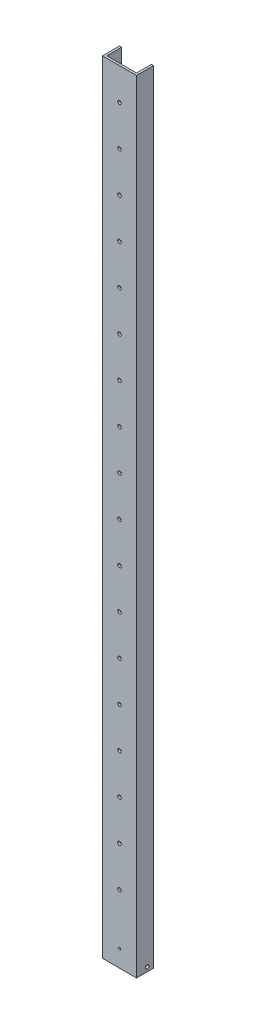
ISO-10303-21;
HEADER;
FILE_DESCRIPTION(('STEP AP214'),'2;1');
FILE_NAME('part.step','',(''),(''),'','','');
FILE_SCHEMA(('AUTOMOTIVE_DESIGN { 1 0 10303 214 1 1 1 1 }'));
ENDSEC;
DATA;
#1=APPLICATION_CONTEXT('core data for automotive mechanical design processes');
#2=APPLICATION_PROTOCOL_DEFINITION('international standard','automotive_design',2000,#1);
#3=PRODUCT_CONTEXT('',#1,'mechanical');
#4=PRODUCT('Part','Part','',(#3));
#5=PRODUCT_RELATED_PRODUCT_CATEGORY('part','',(#4));
#6=PRODUCT_DEFINITION_FORMATION('','',#4);
#7=PRODUCT_DEFINITION_CONTEXT('part definition',#1,'design');
#8=PRODUCT_DEFINITION('design','',#6,#7);
#9=PRODUCT_DEFINITION_SHAPE('','',#8);
#10=(LENGTH_UNIT() NAMED_UNIT(*) SI_UNIT(.MILLI.,.METRE.));
#11=(NAMED_UNIT(*) PLANE_ANGLE_UNIT() SI_UNIT($,.RADIAN.));
#12=(NAMED_UNIT(*) SI_UNIT($,.STERADIAN.) SOLID_ANGLE_UNIT());
#13=UNCERTAINTY_MEASURE_WITH_UNIT(LENGTH_MEASURE(1.E-05),#10,'distance_accuracy_value','');
#14=(GEOMETRIC_REPRESENTATION_CONTEXT(3) GLOBAL_UNCERTAINTY_ASSIGNED_CONTEXT((#13)) GLOBAL_UNIT_ASSIGNED_CONTEXT((#10,
#11,#12)) REPRESENTATION_CONTEXT('',''));
#15=CARTESIAN_POINT('',(0.,0.,0.));
#16=DIRECTION('',(0.,0.,1.));
#17=DIRECTION('',(1.,0.,0.));
#18=AXIS2_PLACEMENT_3D('',#15,#16,#17);
#19=CARTESIAN_POINT('',(0.,1168.4,0.));
#20=DIRECTION('',(1.,0.,0.));
#21=DIRECTION('',(0.,0.,-1.));
#22=AXIS2_PLACEMENT_3D('',#19,#20,#21);
#23=PLANE('',#22);
#24=CARTESIAN_POINT('',(0.,6.35,-15.875));
#25=DIRECTION('',(-1.,0.,0.));
#26=DIRECTION('',(0.,0.,1.));
#27=AXIS2_PLACEMENT_3D('',#24,#25,#26);
#28=CIRCLE('',#27,2.667);
#29=CARTESIAN_POINT('',(0.,6.35,-13.208));
#30=VERTEX_POINT('',#29);
#31=EDGE_CURVE('E295',#30,#30,#28,.T.);
#32=ORIENTED_EDGE('',*,*,#31,.F.);
#33=EDGE_LOOP('',(#32));
#34=FACE_BOUND('',#33,.T.);
#35=DIRECTION('',(0.,0.,1.));
#36=VECTOR('',#35,1.);
#37=CARTESIAN_POINT('',(0.,0.,0.));
#38=LINE('',#37,#36);
#39=CARTESIAN_POINT('',(0.,0.,-25.4));
#40=VERTEX_POINT('',#39);
#41=CARTESIAN_POINT('',(0.,0.,0.));
#42=VERTEX_POINT('',#41);
#43=EDGE_CURVE('E130',#40,#42,#38,.T.);
#44=ORIENTED_EDGE('',*,*,#43,.T.);
#45=DIRECTION('',(0.,-1.,0.));
#46=VECTOR('',#45,1.);
#47=CARTESIAN_POINT('',(0.,1168.4,0.));
#48=LINE('',#47,#46);
#49=CARTESIAN_POINT('',(0.,1168.4,0.));
#50=VERTEX_POINT('',#49);
#51=EDGE_CURVE('E11',#50,#42,#48,.T.);
#52=ORIENTED_EDGE('',*,*,#51,.F.);
#53=DIRECTION('',(0.,0.,1.));
#54=VECTOR('',#53,1.);
#55=CARTESIAN_POINT('',(0.,1168.4,0.));
#56=LINE('',#55,#54);
#57=CARTESIAN_POINT('',(0.,1168.4,-25.4));
#58=VERTEX_POINT('',#57);
#59=EDGE_CURVE('E145',#58,#50,#56,.T.);
#60=ORIENTED_EDGE('',*,*,#59,.F.);
#61=DIRECTION('',(0.,-1.,0.));
#62=VECTOR('',#61,1.);
#63=CARTESIAN_POINT('',(0.,1168.4,-25.4));
#64=LINE('',#63,#62);
#65=EDGE_CURVE('E126',#58,#40,#64,.T.);
#66=ORIENTED_EDGE('',*,*,#65,.T.);
#67=EDGE_LOOP('',(#44,#52,#60,#66));
#68=FACE_BOUND('',#67,.T.);
#69=ADVANCED_FACE('F33',(#34,#68),#23,.F.);
#70=CARTESIAN_POINT('',(0.,1168.4,0.));
#71=DIRECTION('',(0.,0.,-1.));
#72=DIRECTION('',(-1.,0.,0.));
#73=AXIS2_PLACEMENT_3D('',#70,#71,#72);
#74=PLANE('',#73);
#75=CARTESIAN_POINT('',(25.4,25.4,0.));
#76=DIRECTION('',(0.,0.,-1.));
#77=DIRECTION('',(-1.,0.,0.));
#78=AXIS2_PLACEMENT_3D('',#75,#76,#77);
#79=CIRCLE('',#78,1.5875);
#80=CARTESIAN_POINT('',(23.8125,25.4,0.));
#81=VERTEX_POINT('',#80);
#82=EDGE_CURVE('E186',#81,#81,#79,.F.);
#83=ORIENTED_EDGE('',*,*,#82,.F.);
#84=EDGE_LOOP('',(#83));
#85=FACE_BOUND('',#84,.T.);
#86=CARTESIAN_POINT('',(25.4,101.6,0.));
#87=DIRECTION('',(0.,0.,1.));
#88=DIRECTION('',(1.,0.,0.));
#89=AXIS2_PLACEMENT_3D('',#86,#87,#88);
#90=CIRCLE('',#89,2.667);
#91=CARTESIAN_POINT('',(28.067,101.6,0.));
#92=VERTEX_POINT('',#91);
#93=EDGE_CURVE('E280',#92,#92,#90,.T.);
#94=ORIENTED_EDGE('',*,*,#93,.F.);
#95=EDGE_LOOP('',(#94));
#96=FACE_BOUND('',#95,.T.);
#97=CARTESIAN_POINT('',(25.4,161.544,0.));
#98=DIRECTION('',(0.,0.,1.));
#99=DIRECTION('',(1.,0.,0.));
#100=AXIS2_PLACEMENT_3D('',#97,#98,#99);
#101=CIRCLE('',#100,2.667);
#102=CARTESIAN_POINT('',(28.067,161.544,0.));
#103=VERTEX_POINT('',#102);
#104=EDGE_CURVE('E274',#103,#103,#101,.T.);
#105=ORIENTED_EDGE('',*,*,#104,.F.);
#106=EDGE_LOOP('',(#105));
#107=FACE_BOUND('',#106,.T.);
#108=CARTESIAN_POINT('',(25.4,221.488,0.));
#109=DIRECTION('',(0.,0.,1.));
#110=DIRECTION('',(1.,0.,0.));
#111=AXIS2_PLACEMENT_3D('',#108,#109,#110);
#112=CIRCLE('',#111,2.667);
#113=CARTESIAN_POINT('',(28.067,221.488,0.));
#114=VERTEX_POINT('',#113);
#115=EDGE_CURVE('E268',#114,#114,#112,.T.);
#116=ORIENTED_EDGE('',*,*,#115,.F.);
#117=EDGE_LOOP('',(#116));
#118=FACE_BOUND('',#117,.T.);
#119=CARTESIAN_POINT('',(25.4,281.432,0.));
#120=DIRECTION('',(0.,0.,1.));
#121=DIRECTION('',(1.,0.,0.));
#122=AXIS2_PLACEMENT_3D('',#119,#120,#121);
#123=CIRCLE('',#122,2.667);
#124=CARTESIAN_POINT('',(28.067,281.432,0.));
#125=VERTEX_POINT('',#124);
#126=EDGE_CURVE('E262',#125,#125,#123,.T.);
#127=ORIENTED_EDGE('',*,*,#126,.F.);
#128=EDGE_LOOP('',(#127));
#129=FACE_BOUND('',#128,.T.);
#130=CARTESIAN_POINT('',(25.4,341.376,0.));
#131=DIRECTION('',(0.,0.,1.));
#132=DIRECTION('',(1.,0.,0.));
#133=AXIS2_PLACEMENT_3D('',#130,#131,#132);
#134=CIRCLE('',#133,2.667);
#135=CARTESIAN_POINT('',(28.067,341.376,0.));
#136=VERTEX_POINT('',#135);
#137=EDGE_CURVE('E256',#136,#136,#134,.T.);
#138=ORIENTED_EDGE('',*,*,#137,.F.);
#139=EDGE_LOOP('',(#138));
#140=FACE_BOUND('',#139,.T.);
#141=CARTESIAN_POINT('',(25.4,401.32,0.));
#142=DIRECTION('',(0.,0.,1.));
#143=DIRECTION('',(1.,0.,0.));
#144=AXIS2_PLACEMENT_3D('',#141,#142,#143);
#145=CIRCLE('',#144,2.667);
#146=CARTESIAN_POINT('',(28.067,401.32,0.));
#147=VERTEX_POINT('',#146);
#148=EDGE_CURVE('E250',#147,#147,#145,.T.);
#149=ORIENTED_EDGE('',*,*,#148,.F.);
#150=EDGE_LOOP('',(#149));
#151=FACE_BOUND('',#150,.T.);
#152=CARTESIAN_POINT('',(25.4,461.264,0.));
#153=DIRECTION('',(0.,0.,1.));
#154=DIRECTION('',(1.,0.,0.));
#155=AXIS2_PLACEMENT_3D('',#152,#153,#154);
#156=CIRCLE('',#155,2.667);
#157=CARTESIAN_POINT('',(28.067,461.264,0.));
#158=VERTEX_POINT('',#157);
#159=EDGE_CURVE('E244',#158,#158,#156,.T.);
#160=ORIENTED_EDGE('',*,*,#159,.F.);
#161=EDGE_LOOP('',(#160));
#162=FACE_BOUND('',#161,.T.);
#163=CARTESIAN_POINT('',(25.4,521.208,0.));
#164=DIRECTION('',(0.,0.,1.));
#165=DIRECTION('',(1.,0.,0.));
#166=AXIS2_PLACEMENT_3D('',#163,#164,#165);
#167=CIRCLE('',#166,2.667);
#168=CARTESIAN_POINT('',(28.067,521.208,0.));
#169=VERTEX_POINT('',#168);
#170=EDGE_CURVE('E238',#169,#169,#167,.T.);
#171=ORIENTED_EDGE('',*,*,#170,.F.);
#172=EDGE_LOOP('',(#171));
#173=FACE_BOUND('',#172,.T.);
#174=CARTESIAN_POINT('',(25.4,581.152,0.));
#175=DIRECTION('',(0.,0.,1.));
#176=DIRECTION('',(1.,0.,0.));
#177=AXIS2_PLACEMENT_3D('',#174,#175,#176);
#178=CIRCLE('',#177,2.66700000000003);
#179=CARTESIAN_POINT('',(28.067,581.152,0.));
#180=VERTEX_POINT('',#179);
#181=EDGE_CURVE('E232',#180,#180,#178,.T.);
#182=ORIENTED_EDGE('',*,*,#181,.F.);
#183=EDGE_LOOP('',(#182));
#184=FACE_BOUND('',#183,.T.);
#185=CARTESIAN_POINT('',(25.4,641.096,0.));
#186=DIRECTION('',(0.,0.,1.));
#187=DIRECTION('',(1.,0.,0.));
#188=AXIS2_PLACEMENT_3D('',#185,#186,#187);
#189=CIRCLE('',#188,2.667);
#190=CARTESIAN_POINT('',(28.067,641.096,0.));
#191=VERTEX_POINT('',#190);
#192=EDGE_CURVE('E226',#191,#191,#189,.T.);
#193=ORIENTED_EDGE('',*,*,#192,.F.);
#194=EDGE_LOOP('',(#193));
#195=FACE_BOUND('',#194,.T.);
#196=CARTESIAN_POINT('',(25.4,701.04,0.));
#197=DIRECTION('',(0.,0.,1.));
#198=DIRECTION('',(1.,0.,0.));
#199=AXIS2_PLACEMENT_3D('',#196,#197,#198);
#200=CIRCLE('',#199,2.667);
#201=CARTESIAN_POINT('',(28.067,701.04,0.));
#202=VERTEX_POINT('',#201);
#203=EDGE_CURVE('E220',#202,#202,#200,.T.);
#204=ORIENTED_EDGE('',*,*,#203,.F.);
#205=EDGE_LOOP('',(#204));
#206=FACE_BOUND('',#205,.T.);
#207=CARTESIAN_POINT('',(25.4,760.984,0.));
#208=DIRECTION('',(0.,0.,1.));
#209=DIRECTION('',(1.,0.,0.));
#210=AXIS2_PLACEMENT_3D('',#207,#208,#209);
#211=CIRCLE('',#210,2.667);
#212=CARTESIAN_POINT('',(28.067,760.984,0.));
#213=VERTEX_POINT('',#212);
#214=EDGE_CURVE('E214',#213,#213,#211,.T.);
#215=ORIENTED_EDGE('',*,*,#214,.F.);
#216=EDGE_LOOP('',(#215));
#217=FACE_BOUND('',#216,.T.);
#218=CARTESIAN_POINT('',(25.4,820.928,0.));
#219=DIRECTION('',(0.,0.,1.));
#220=DIRECTION('',(1.,0.,0.));
#221=AXIS2_PLACEMENT_3D('',#218,#219,#220);
#222=CIRCLE('',#221,2.667);
#223=CARTESIAN_POINT('',(28.067,820.928,0.));
#224=VERTEX_POINT('',#223);
#225=EDGE_CURVE('E208',#224,#224,#222,.T.);
#226=ORIENTED_EDGE('',*,*,#225,.F.);
#227=EDGE_LOOP('',(#226));
#228=FACE_BOUND('',#227,.T.);
#229=CARTESIAN_POINT('',(25.4,880.872,0.));
#230=DIRECTION('',(0.,0.,1.));
#231=DIRECTION('',(1.,0.,0.));
#232=AXIS2_PLACEMENT_3D('',#229,#230,#231);
#233=CIRCLE('',#232,2.667);
#234=CARTESIAN_POINT('',(28.067,880.872,0.));
#235=VERTEX_POINT('',#234);
#236=EDGE_CURVE('E202',#235,#235,#233,.T.);
#237=ORIENTED_EDGE('',*,*,#236,.F.);
#238=EDGE_LOOP('',(#237));
#239=FACE_BOUND('',#238,.T.);
#240=CARTESIAN_POINT('',(25.4,940.816,0.));
#241=DIRECTION('',(0.,0.,1.));
#242=DIRECTION('',(1.,0.,0.));
#243=AXIS2_PLACEMENT_3D('',#240,#241,#242);
#244=CIRCLE('',#243,2.667);
#245=CARTESIAN_POINT('',(28.067,940.816,0.));
#246=VERTEX_POINT('',#245);
#247=EDGE_CURVE('E196',#246,#246,#244,.T.);
#248=ORIENTED_EDGE('',*,*,#247,.F.);
#249=EDGE_LOOP('',(#248));
#250=FACE_BOUND('',#249,.T.);
#251=CARTESIAN_POINT('',(25.4,1000.76,0.));
#252=DIRECTION('',(0.,0.,1.));
#253=DIRECTION('',(1.,0.,0.));
#254=AXIS2_PLACEMENT_3D('',#251,#252,#253);
#255=CIRCLE('',#254,2.66700000000003);
#256=CARTESIAN_POINT('',(28.067,1000.76,0.));
#257=VERTEX_POINT('',#256);
#258=EDGE_CURVE('E190',#257,#257,#255,.T.);
#259=ORIENTED_EDGE('',*,*,#258,.F.);
#260=EDGE_LOOP('',(#259));
#261=FACE_BOUND('',#260,.T.);
#262=CARTESIAN_POINT('',(25.4,1060.704,0.));
#263=DIRECTION('',(0.,0.,1.));
#264=DIRECTION('',(1.,0.,0.));
#265=AXIS2_PLACEMENT_3D('',#262,#263,#264);
#266=CIRCLE('',#265,2.66700000000003);
#267=CARTESIAN_POINT('',(28.067,1060.704,0.));
#268=VERTEX_POINT('',#267);
#269=EDGE_CURVE('E182',#268,#268,#266,.T.);
#270=ORIENTED_EDGE('',*,*,#269,.F.);
#271=EDGE_LOOP('',(#270));
#272=FACE_BOUND('',#271,.T.);
#273=CARTESIAN_POINT('',(25.4,1120.648,0.));
#274=DIRECTION('',(0.,0.,1.));
#275=DIRECTION('',(1.,0.,0.));
#276=AXIS2_PLACEMENT_3D('',#273,#274,#275);
#277=CIRCLE('',#276,2.66700000000003);
#278=CARTESIAN_POINT('',(28.067,1120.648,0.));
#279=VERTEX_POINT('',#278);
#280=EDGE_CURVE('E183',#279,#279,#277,.T.);
#281=ORIENTED_EDGE('',*,*,#280,.F.);
#282=EDGE_LOOP('',(#281));
#283=FACE_BOUND('',#282,.T.);
#284=DIRECTION('',(1.,0.,0.));
#285=VECTOR('',#284,1.);
#286=CARTESIAN_POINT('',(0.,0.,0.));
#287=LINE('',#286,#285);
#288=CARTESIAN_POINT('',(50.8,0.,0.));
#289=VERTEX_POINT('',#288);
#290=EDGE_CURVE('E133',#42,#289,#287,.T.);
#291=ORIENTED_EDGE('',*,*,#290,.T.);
#292=DIRECTION('',(0.,-1.,0.));
#293=VECTOR('',#292,1.);
#294=CARTESIAN_POINT('',(50.8,1168.4,0.));
#295=LINE('',#294,#293);
#296=CARTESIAN_POINT('',(50.8,1168.4,0.));
#297=VERTEX_POINT('',#296);
#298=EDGE_CURVE('E42',#297,#289,#295,.T.);
#299=ORIENTED_EDGE('',*,*,#298,.F.);
#300=DIRECTION('',(1.,0.,0.));
#301=VECTOR('',#300,1.);
#302=CARTESIAN_POINT('',(0.,1168.4,0.));
#303=LINE('',#302,#301);
#304=EDGE_CURVE('E93',#50,#297,#303,.T.);
#305=ORIENTED_EDGE('',*,*,#304,.F.);
#306=ORIENTED_EDGE('',*,*,#51,.T.);
#307=EDGE_LOOP('',(#291,#299,#305,#306));
#308=FACE_BOUND('',#307,.T.);
#309=ADVANCED_FACE('F321',(#85,#96,#107,#118,#129,#140,#151,#162,#173,#184,#195,#206,#217,#228,
#239,#250,#261,#272,#283,#308),#74,.F.);
#310=CARTESIAN_POINT('',(50.8,1168.4,0.));
#311=DIRECTION('',(-1.,0.,0.));
#312=DIRECTION('',(0.,0.,1.));
#313=AXIS2_PLACEMENT_3D('',#310,#311,#312);
#314=PLANE('',#313);
#315=CARTESIAN_POINT('',(50.8,6.35,-15.875));
#316=DIRECTION('',(-1.,0.,0.));
#317=DIRECTION('',(0.,0.,1.));
#318=AXIS2_PLACEMENT_3D('',#315,#316,#317);
#319=CIRCLE('',#318,2.667);
#320=CARTESIAN_POINT('',(50.8,6.35,-13.208));
#321=VERTEX_POINT('',#320);
#322=EDGE_CURVE('E298',#321,#321,#319,.T.);
#323=ORIENTED_EDGE('',*,*,#322,.T.);
#324=EDGE_LOOP('',(#323));
#325=FACE_BOUND('',#324,.T.);
#326=DIRECTION('',(0.,0.,-1.));
#327=VECTOR('',#326,1.);
#328=CARTESIAN_POINT('',(50.8,0.,0.));
#329=LINE('',#328,#327);
#330=CARTESIAN_POINT('',(50.8,0.,-25.4));
#331=VERTEX_POINT('',#330);
#332=EDGE_CURVE('E136',#289,#331,#329,.T.);
#333=ORIENTED_EDGE('',*,*,#332,.T.);
#334=DIRECTION('',(0.,-1.,0.));
#335=VECTOR('',#334,1.);
#336=CARTESIAN_POINT('',(50.8,1168.4,-25.4));
#337=LINE('',#336,#335);
#338=CARTESIAN_POINT('',(50.8,1168.4,-25.4));
#339=VERTEX_POINT('',#338);
#340=EDGE_CURVE('E152',#339,#331,#337,.T.);
#341=ORIENTED_EDGE('',*,*,#340,.F.);
#342=DIRECTION('',(0.,0.,-1.));
#343=VECTOR('',#342,1.);
#344=CARTESIAN_POINT('',(50.8,1168.4,0.));
#345=LINE('',#344,#343);
#346=EDGE_CURVE('E161',#297,#339,#345,.T.);
#347=ORIENTED_EDGE('',*,*,#346,.F.);
#348=ORIENTED_EDGE('',*,*,#298,.T.);
#349=EDGE_LOOP('',(#333,#341,#347,#348));
#350=FACE_BOUND('',#349,.T.);
#351=ADVANCED_FACE('F159',(#325,#350),#314,.F.);
#352=CARTESIAN_POINT('',(50.8,1168.4,-25.4));
#353=DIRECTION('',(0.,0.,1.));
#354=DIRECTION('',(1.,0.,0.));
#355=AXIS2_PLACEMENT_3D('',#352,#353,#354);
#356=PLANE('',#355);
#357=DIRECTION('',(-1.,0.,0.));
#358=VECTOR('',#357,1.);
#359=CARTESIAN_POINT('',(50.8,0.,-25.4));
#360=LINE('',#359,#358);
#361=CARTESIAN_POINT('',(47.625,0.,-25.4));
#362=VERTEX_POINT('',#361);
#363=EDGE_CURVE('E138',#331,#362,#360,.T.);
#364=ORIENTED_EDGE('',*,*,#363,.T.);
#365=DIRECTION('',(0.,-1.,0.));
#366=VECTOR('',#365,1.);
#367=CARTESIAN_POINT('',(47.625,1168.4,-25.4));
#368=LINE('',#367,#366);
#369=CARTESIAN_POINT('',(47.625,1168.4,-25.4));
#370=VERTEX_POINT('',#369);
#371=EDGE_CURVE('E149',#370,#362,#368,.T.);
#372=ORIENTED_EDGE('',*,*,#371,.F.);
#373=DIRECTION('',(-1.,0.,0.));
#374=VECTOR('',#373,1.);
#375=CARTESIAN_POINT('',(50.8,1168.4,-25.4));
#376=LINE('',#375,#374);
#377=EDGE_CURVE('E173',#339,#370,#376,.T.);
#378=ORIENTED_EDGE('',*,*,#377,.F.);
#379=ORIENTED_EDGE('',*,*,#340,.T.);
#380=EDGE_LOOP('',(#364,#372,#378,#379));
#381=FACE_BOUND('',#380,.T.);
#382=ADVANCED_FACE('F169',(#381),#356,.F.);
#383=CARTESIAN_POINT('',(47.625,1168.4,-3.175));
#384=DIRECTION('',(1.,0.,0.));
#385=DIRECTION('',(0.,0.,-1.));
#386=AXIS2_PLACEMENT_3D('',#383,#384,#385);
#387=PLANE('',#386);
#388=CARTESIAN_POINT('',(47.625,6.35,-15.875));
#389=DIRECTION('',(1.,0.,0.));
#390=DIRECTION('',(0.,0.,-1.));
#391=AXIS2_PLACEMENT_3D('',#388,#389,#390);
#392=CIRCLE('',#391,2.667);
#393=CARTESIAN_POINT('',(47.625,6.35,-18.542));
#394=VERTEX_POINT('',#393);
#395=EDGE_CURVE('E292',#394,#394,#392,.T.);
#396=ORIENTED_EDGE('',*,*,#395,.T.);
#397=EDGE_LOOP('',(#396));
#398=FACE_BOUND('',#397,.T.);
#399=DIRECTION('',(0.,0.,1.));
#400=VECTOR('',#399,1.);
#401=CARTESIAN_POINT('',(47.625,0.,-3.175));
#402=LINE('',#401,#400);
#403=CARTESIAN_POINT('',(47.625,0.,-3.175));
#404=VERTEX_POINT('',#403);
#405=EDGE_CURVE('E140',#362,#404,#402,.T.);
#406=ORIENTED_EDGE('',*,*,#405,.T.);
#407=DIRECTION('',(0.,-1.,0.));
#408=VECTOR('',#407,1.);
#409=CARTESIAN_POINT('',(47.625,1168.4,-3.175));
#410=LINE('',#409,#408);
#411=CARTESIAN_POINT('',(47.625,1168.4,-3.175));
#412=VERTEX_POINT('',#411);
#413=EDGE_CURVE('E121',#412,#404,#410,.T.);
#414=ORIENTED_EDGE('',*,*,#413,.F.);
#415=DIRECTION('',(0.,0.,1.));
#416=VECTOR('',#415,1.);
#417=CARTESIAN_POINT('',(47.625,1168.4,-3.175));
#418=LINE('',#417,#416);
#419=EDGE_CURVE('E112',#370,#412,#418,.T.);
#420=ORIENTED_EDGE('',*,*,#419,.F.);
#421=ORIENTED_EDGE('',*,*,#371,.T.);
#422=EDGE_LOOP('',(#406,#414,#420,#421));
#423=FACE_BOUND('',#422,.T.);
#424=ADVANCED_FACE('F172',(#398,#423),#387,.F.);
#425=CARTESIAN_POINT('',(3.175,1168.4,-3.175));
#426=DIRECTION('',(0.,0.,1.));
#427=DIRECTION('',(1.,0.,0.));
#428=AXIS2_PLACEMENT_3D('',#425,#426,#427);
#429=PLANE('',#428);
#430=CARTESIAN_POINT('',(25.4,25.4,-3.175));
#431=DIRECTION('',(0.,0.,-1.));
#432=DIRECTION('',(-1.,0.,0.));
#433=AXIS2_PLACEMENT_3D('',#430,#431,#432);
#434=CIRCLE('',#433,1.5875);
#435=CARTESIAN_POINT('',(23.8125,25.4,-3.175));
#436=VERTEX_POINT('',#435);
#437=EDGE_CURVE('E289',#436,#436,#434,.T.);
#438=ORIENTED_EDGE('',*,*,#437,.F.);
#439=EDGE_LOOP('',(#438));
#440=FACE_BOUND('',#439,.T.);
#441=CARTESIAN_POINT('',(25.4,101.6,-3.175));
#442=DIRECTION('',(0.,0.,1.));
#443=DIRECTION('',(1.,0.,0.));
#444=AXIS2_PLACEMENT_3D('',#441,#442,#443);
#445=CIRCLE('',#444,2.667);
#446=CARTESIAN_POINT('',(28.067,101.6,-3.175));
#447=VERTEX_POINT('',#446);
#448=EDGE_CURVE('E134',#447,#447,#445,.F.);
#449=ORIENTED_EDGE('',*,*,#448,.F.);
#450=EDGE_LOOP('',(#449));
#451=FACE_BOUND('',#450,.T.);
#452=CARTESIAN_POINT('',(25.4,161.544,-3.175));
#453=DIRECTION('',(0.,0.,1.));
#454=DIRECTION('',(1.,0.,0.));
#455=AXIS2_PLACEMENT_3D('',#452,#453,#454);
#456=CIRCLE('',#455,2.667);
#457=CARTESIAN_POINT('',(28.067,161.544,-3.175));
#458=VERTEX_POINT('',#457);
#459=EDGE_CURVE('E277',#458,#458,#456,.F.);
#460=ORIENTED_EDGE('',*,*,#459,.F.);
#461=EDGE_LOOP('',(#460));
#462=FACE_BOUND('',#461,.T.);
#463=CARTESIAN_POINT('',(25.4,221.488,-3.175));
#464=DIRECTION('',(0.,0.,1.));
#465=DIRECTION('',(1.,0.,0.));
#466=AXIS2_PLACEMENT_3D('',#463,#464,#465);
#467=CIRCLE('',#466,2.667);
#468=CARTESIAN_POINT('',(28.067,221.488,-3.175));
#469=VERTEX_POINT('',#468);
#470=EDGE_CURVE('E271',#469,#469,#467,.F.);
#471=ORIENTED_EDGE('',*,*,#470,.F.);
#472=EDGE_LOOP('',(#471));
#473=FACE_BOUND('',#472,.T.);
#474=CARTESIAN_POINT('',(25.4,281.432,-3.175));
#475=DIRECTION('',(0.,0.,1.));
#476=DIRECTION('',(1.,0.,0.));
#477=AXIS2_PLACEMENT_3D('',#474,#475,#476);
#478=CIRCLE('',#477,2.667);
#479=CARTESIAN_POINT('',(28.067,281.432,-3.175));
#480=VERTEX_POINT('',#479);
#481=EDGE_CURVE('E265',#480,#480,#478,.F.);
#482=ORIENTED_EDGE('',*,*,#481,.F.);
#483=EDGE_LOOP('',(#482));
#484=FACE_BOUND('',#483,.T.);
#485=CARTESIAN_POINT('',(25.4,341.376,-3.175));
#486=DIRECTION('',(0.,0.,1.));
#487=DIRECTION('',(1.,0.,0.));
#488=AXIS2_PLACEMENT_3D('',#485,#486,#487);
#489=CIRCLE('',#488,2.667);
#490=CARTESIAN_POINT('',(28.067,341.376,-3.175));
#491=VERTEX_POINT('',#490);
#492=EDGE_CURVE('E259',#491,#491,#489,.F.);
#493=ORIENTED_EDGE('',*,*,#492,.F.);
#494=EDGE_LOOP('',(#493));
#495=FACE_BOUND('',#494,.T.);
#496=CARTESIAN_POINT('',(25.4,401.32,-3.175));
#497=DIRECTION('',(0.,0.,1.));
#498=DIRECTION('',(1.,0.,0.));
#499=AXIS2_PLACEMENT_3D('',#496,#497,#498);
#500=CIRCLE('',#499,2.667);
#501=CARTESIAN_POINT('',(28.067,401.32,-3.175));
#502=VERTEX_POINT('',#501);
#503=EDGE_CURVE('E253',#502,#502,#500,.F.);
#504=ORIENTED_EDGE('',*,*,#503,.F.);
#505=EDGE_LOOP('',(#504));
#506=FACE_BOUND('',#505,.T.);
#507=CARTESIAN_POINT('',(25.4,461.264,-3.175));
#508=DIRECTION('',(0.,0.,1.));
#509=DIRECTION('',(1.,0.,0.));
#510=AXIS2_PLACEMENT_3D('',#507,#508,#509);
#511=CIRCLE('',#510,2.667);
#512=CARTESIAN_POINT('',(28.067,461.264,-3.175));
#513=VERTEX_POINT('',#512);
#514=EDGE_CURVE('E247',#513,#513,#511,.F.);
#515=ORIENTED_EDGE('',*,*,#514,.F.);
#516=EDGE_LOOP('',(#515));
#517=FACE_BOUND('',#516,.T.);
#518=CARTESIAN_POINT('',(25.4,521.208,-3.175));
#519=DIRECTION('',(0.,0.,1.));
#520=DIRECTION('',(1.,0.,0.));
#521=AXIS2_PLACEMENT_3D('',#518,#519,#520);
#522=CIRCLE('',#521,2.667);
#523=CARTESIAN_POINT('',(28.067,521.208,-3.175));
#524=VERTEX_POINT('',#523);
#525=EDGE_CURVE('E241',#524,#524,#522,.F.);
#526=ORIENTED_EDGE('',*,*,#525,.F.);
#527=EDGE_LOOP('',(#526));
#528=FACE_BOUND('',#527,.T.);
#529=CARTESIAN_POINT('',(25.4,581.152,-3.175));
#530=DIRECTION('',(0.,0.,1.));
#531=DIRECTION('',(1.,0.,0.));
#532=AXIS2_PLACEMENT_3D('',#529,#530,#531);
#533=CIRCLE('',#532,2.66700000000003);
#534=CARTESIAN_POINT('',(28.067,581.152,-3.175));
#535=VERTEX_POINT('',#534);
#536=EDGE_CURVE('E235',#535,#535,#533,.F.);
#537=ORIENTED_EDGE('',*,*,#536,.F.);
#538=EDGE_LOOP('',(#537));
#539=FACE_BOUND('',#538,.T.);
#540=CARTESIAN_POINT('',(25.4,641.096,-3.175));
#541=DIRECTION('',(0.,0.,1.));
#542=DIRECTION('',(1.,0.,0.));
#543=AXIS2_PLACEMENT_3D('',#540,#541,#542);
#544=CIRCLE('',#543,2.667);
#545=CARTESIAN_POINT('',(28.067,641.096,-3.175));
#546=VERTEX_POINT('',#545);
#547=EDGE_CURVE('E229',#546,#546,#544,.F.);
#548=ORIENTED_EDGE('',*,*,#547,.F.);
#549=EDGE_LOOP('',(#548));
#550=FACE_BOUND('',#549,.T.);
#551=CARTESIAN_POINT('',(25.4,701.04,-3.175));
#552=DIRECTION('',(0.,0.,1.));
#553=DIRECTION('',(1.,0.,0.));
#554=AXIS2_PLACEMENT_3D('',#551,#552,#553);
#555=CIRCLE('',#554,2.667);
#556=CARTESIAN_POINT('',(28.067,701.04,-3.175));
#557=VERTEX_POINT('',#556);
#558=EDGE_CURVE('E223',#557,#557,#555,.F.);
#559=ORIENTED_EDGE('',*,*,#558,.F.);
#560=EDGE_LOOP('',(#559));
#561=FACE_BOUND('',#560,.T.);
#562=CARTESIAN_POINT('',(25.4,760.984,-3.175));
#563=DIRECTION('',(0.,0.,1.));
#564=DIRECTION('',(1.,0.,0.));
#565=AXIS2_PLACEMENT_3D('',#562,#563,#564);
#566=CIRCLE('',#565,2.667);
#567=CARTESIAN_POINT('',(28.067,760.984,-3.175));
#568=VERTEX_POINT('',#567);
#569=EDGE_CURVE('E217',#568,#568,#566,.F.);
#570=ORIENTED_EDGE('',*,*,#569,.F.);
#571=EDGE_LOOP('',(#570));
#572=FACE_BOUND('',#571,.T.);
#573=CARTESIAN_POINT('',(25.4,820.928,-3.175));
#574=DIRECTION('',(0.,0.,1.));
#575=DIRECTION('',(1.,0.,0.));
#576=AXIS2_PLACEMENT_3D('',#573,#574,#575);
#577=CIRCLE('',#576,2.667);
#578=CARTESIAN_POINT('',(28.067,820.928,-3.175));
#579=VERTEX_POINT('',#578);
#580=EDGE_CURVE('E211',#579,#579,#577,.F.);
#581=ORIENTED_EDGE('',*,*,#580,.F.);
#582=EDGE_LOOP('',(#581));
#583=FACE_BOUND('',#582,.T.);
#584=CARTESIAN_POINT('',(25.4,880.872,-3.175));
#585=DIRECTION('',(0.,0.,1.));
#586=DIRECTION('',(1.,0.,0.));
#587=AXIS2_PLACEMENT_3D('',#584,#585,#586);
#588=CIRCLE('',#587,2.667);
#589=CARTESIAN_POINT('',(28.067,880.872,-3.175));
#590=VERTEX_POINT('',#589);
#591=EDGE_CURVE('E205',#590,#590,#588,.F.);
#592=ORIENTED_EDGE('',*,*,#591,.F.);
#593=EDGE_LOOP('',(#592));
#594=FACE_BOUND('',#593,.T.);
#595=CARTESIAN_POINT('',(25.4,940.816,-3.175));
#596=DIRECTION('',(0.,0.,1.));
#597=DIRECTION('',(1.,0.,0.));
#598=AXIS2_PLACEMENT_3D('',#595,#596,#597);
#599=CIRCLE('',#598,2.667);
#600=CARTESIAN_POINT('',(28.067,940.816,-3.175));
#601=VERTEX_POINT('',#600);
#602=EDGE_CURVE('E199',#601,#601,#599,.F.);
#603=ORIENTED_EDGE('',*,*,#602,.F.);
#604=EDGE_LOOP('',(#603));
#605=FACE_BOUND('',#604,.T.);
#606=CARTESIAN_POINT('',(25.4,1000.76,-3.175));
#607=DIRECTION('',(0.,0.,1.));
#608=DIRECTION('',(1.,0.,0.));
#609=AXIS2_PLACEMENT_3D('',#606,#607,#608);
#610=CIRCLE('',#609,2.66700000000003);
#611=CARTESIAN_POINT('',(28.067,1000.76,-3.175));
#612=VERTEX_POINT('',#611);
#613=EDGE_CURVE('E193',#612,#612,#610,.F.);
#614=ORIENTED_EDGE('',*,*,#613,.F.);
#615=EDGE_LOOP('',(#614));
#616=FACE_BOUND('',#615,.T.);
#617=CARTESIAN_POINT('',(25.4,1060.704,-3.175));
#618=DIRECTION('',(0.,0.,1.));
#619=DIRECTION('',(1.,0.,0.));
#620=AXIS2_PLACEMENT_3D('',#617,#618,#619);
#621=CIRCLE('',#620,2.66700000000003);
#622=CARTESIAN_POINT('',(28.067,1060.704,-3.175));
#623=VERTEX_POINT('',#622);
#624=EDGE_CURVE('E187',#623,#623,#621,.F.);
#625=ORIENTED_EDGE('',*,*,#624,.F.);
#626=EDGE_LOOP('',(#625));
#627=FACE_BOUND('',#626,.T.);
#628=CARTESIAN_POINT('',(25.4,1120.648,-3.175));
#629=DIRECTION('',(0.,0.,1.));
#630=DIRECTION('',(1.,0.,0.));
#631=AXIS2_PLACEMENT_3D('',#628,#629,#630);
#632=CIRCLE('',#631,2.66700000000003);
#633=CARTESIAN_POINT('',(28.067,1120.648,-3.175));
#634=VERTEX_POINT('',#633);
#635=EDGE_CURVE('E179',#634,#634,#632,.F.);
#636=ORIENTED_EDGE('',*,*,#635,.F.);
#637=EDGE_LOOP('',(#636));
#638=FACE_BOUND('',#637,.T.);
#639=DIRECTION('',(-1.,0.,0.));
#640=VECTOR('',#639,1.);
#641=CARTESIAN_POINT('',(3.175,0.,-3.175));
#642=LINE('',#641,#640);
#643=CARTESIAN_POINT('',(3.175,0.,-3.175));
#644=VERTEX_POINT('',#643);
#645=EDGE_CURVE('E120',#404,#644,#642,.T.);
#646=ORIENTED_EDGE('',*,*,#645,.T.);
#647=DIRECTION('',(0.,-1.,0.));
#648=VECTOR('',#647,1.);
#649=CARTESIAN_POINT('',(3.175,1168.4,-3.175));
#650=LINE('',#649,#648);
#651=CARTESIAN_POINT('',(3.175,1168.4,-3.175));
#652=VERTEX_POINT('',#651);
#653=EDGE_CURVE('E117',#652,#644,#650,.T.);
#654=ORIENTED_EDGE('',*,*,#653,.F.);
#655=DIRECTION('',(-1.,0.,0.));
#656=VECTOR('',#655,1.);
#657=CARTESIAN_POINT('',(3.175,1168.4,-3.175));
#658=LINE('',#657,#656);
#659=EDGE_CURVE('E106',#412,#652,#658,.T.);
#660=ORIENTED_EDGE('',*,*,#659,.F.);
#661=ORIENTED_EDGE('',*,*,#413,.T.);
#662=EDGE_LOOP('',(#646,#654,#660,#661));
#663=FACE_BOUND('',#662,.T.);
#664=ADVANCED_FACE('F118',(#440,#451,#462,#473,#484,#495,#506,#517,#528,#539,#550,#561,#572,
#583,#594,#605,#616,#627,#638,#663),#429,.F.);
#665=CARTESIAN_POINT('',(3.175,1168.4,-3.175));
#666=DIRECTION('',(-1.,0.,0.));
#667=DIRECTION('',(0.,0.,1.));
#668=AXIS2_PLACEMENT_3D('',#665,#666,#667);
#669=PLANE('',#668);
#670=CARTESIAN_POINT('',(3.175,6.35,-15.875));
#671=DIRECTION('',(-1.,0.,0.));
#672=DIRECTION('',(0.,0.,1.));
#673=AXIS2_PLACEMENT_3D('',#670,#671,#672);
#674=CIRCLE('',#673,2.667);
#675=CARTESIAN_POINT('',(3.175,6.35,-13.208));
#676=VERTEX_POINT('',#675);
#677=EDGE_CURVE('E36',#676,#676,#674,.T.);
#678=ORIENTED_EDGE('',*,*,#677,.T.);
#679=EDGE_LOOP('',(#678));
#680=FACE_BOUND('',#679,.T.);
#681=DIRECTION('',(0.,0.,-1.));
#682=VECTOR('',#681,1.);
#683=CARTESIAN_POINT('',(3.175,0.,-3.175));
#684=LINE('',#683,#682);
#685=CARTESIAN_POINT('',(3.175,0.,-25.4));
#686=VERTEX_POINT('',#685);
#687=EDGE_CURVE('E79',#644,#686,#684,.T.);
#688=ORIENTED_EDGE('',*,*,#687,.T.);
#689=DIRECTION('',(0.,-1.,0.));
#690=VECTOR('',#689,1.);
#691=CARTESIAN_POINT('',(3.175,1168.4,-25.4));
#692=LINE('',#691,#690);
#693=CARTESIAN_POINT('',(3.175,1168.4,-25.4));
#694=VERTEX_POINT('',#693);
#695=EDGE_CURVE('E122',#694,#686,#692,.T.);
#696=ORIENTED_EDGE('',*,*,#695,.F.);
#697=DIRECTION('',(0.,0.,-1.));
#698=VECTOR('',#697,1.);
#699=CARTESIAN_POINT('',(3.175,1168.4,-3.175));
#700=LINE('',#699,#698);
#701=EDGE_CURVE('E110',#652,#694,#700,.T.);
#702=ORIENTED_EDGE('',*,*,#701,.F.);
#703=ORIENTED_EDGE('',*,*,#653,.T.);
#704=EDGE_LOOP('',(#688,#696,#702,#703));
#705=FACE_BOUND('',#704,.T.);
#706=ADVANCED_FACE('F124',(#680,#705),#669,.F.);
#707=CARTESIAN_POINT('',(0.,1168.4,-25.4));
#708=DIRECTION('',(0.,0.,1.));
#709=DIRECTION('',(1.,0.,0.));
#710=AXIS2_PLACEMENT_3D('',#707,#708,#709);
#711=PLANE('',#710);
#712=DIRECTION('',(-1.,0.,0.));
#713=VECTOR('',#712,1.);
#714=CARTESIAN_POINT('',(0.,0.,-25.4));
#715=LINE('',#714,#713);
#716=EDGE_CURVE('E85',#686,#40,#715,.T.);
#717=ORIENTED_EDGE('',*,*,#716,.T.);
#718=ORIENTED_EDGE('',*,*,#65,.F.);
#719=DIRECTION('',(-1.,0.,0.));
#720=VECTOR('',#719,1.);
#721=CARTESIAN_POINT('',(0.,1168.4,-25.4));
#722=LINE('',#721,#720);
#723=EDGE_CURVE('E50',#694,#58,#722,.T.);
#724=ORIENTED_EDGE('',*,*,#723,.F.);
#725=ORIENTED_EDGE('',*,*,#695,.T.);
#726=EDGE_LOOP('',(#717,#718,#724,#725));
#727=FACE_BOUND('',#726,.T.);
#728=ADVANCED_FACE('F331',(#727),#711,.F.);
#729=CARTESIAN_POINT('',(0.,1168.4,0.));
#730=DIRECTION('',(0.,-1.,0.));
#731=DIRECTION('',(0.,0.,-1.));
#732=AXIS2_PLACEMENT_3D('',#729,#730,#731);
#733=PLANE('',#732);
#734=ORIENTED_EDGE('',*,*,#59,.T.);
#735=ORIENTED_EDGE('',*,*,#304,.T.);
#736=ORIENTED_EDGE('',*,*,#346,.T.);
#737=ORIENTED_EDGE('',*,*,#377,.T.);
#738=ORIENTED_EDGE('',*,*,#419,.T.);
#739=ORIENTED_EDGE('',*,*,#659,.T.);
#740=ORIENTED_EDGE('',*,*,#701,.T.);
#741=ORIENTED_EDGE('',*,*,#723,.T.);
#742=EDGE_LOOP('',(#734,#735,#736,#737,#738,#739,#740,#741));
#743=FACE_BOUND('',#742,.T.);
#744=ADVANCED_FACE('F108',(#743),#733,.F.);
#745=CARTESIAN_POINT('',(0.,0.,0.));
#746=DIRECTION('',(0.,-1.,0.));
#747=DIRECTION('',(0.,0.,-1.));
#748=AXIS2_PLACEMENT_3D('',#745,#746,#747);
#749=PLANE('',#748);
#750=ORIENTED_EDGE('',*,*,#43,.F.);
#751=ORIENTED_EDGE('',*,*,#716,.F.);
#752=ORIENTED_EDGE('',*,*,#687,.F.);
#753=ORIENTED_EDGE('',*,*,#645,.F.);
#754=ORIENTED_EDGE('',*,*,#405,.F.);
#755=ORIENTED_EDGE('',*,*,#363,.F.);
#756=ORIENTED_EDGE('',*,*,#332,.F.);
#757=ORIENTED_EDGE('',*,*,#290,.F.);
#758=EDGE_LOOP('',(#750,#751,#752,#753,#754,#755,#756,#757));
#759=FACE_BOUND('',#758,.T.);
#760=ADVANCED_FACE('F165',(#759),#749,.T.);
#761=CARTESIAN_POINT('',(25.4,1120.648,-25.401));
#762=DIRECTION('',(0.,0.,1.));
#763=DIRECTION('',(1.,0.,0.));
#764=AXIS2_PLACEMENT_3D('',#761,#762,#763);
#765=CYLINDRICAL_SURFACE('',#764,2.66700000000003);
#766=ORIENTED_EDGE('',*,*,#280,.T.);
#767=EDGE_LOOP('',(#766));
#768=FACE_BOUND('',#767,.T.);
#769=ORIENTED_EDGE('',*,*,#635,.T.);
#770=EDGE_LOOP('',(#769));
#771=FACE_BOUND('',#770,.T.);
#772=ADVANCED_FACE('F541',(#768,#771),#765,.F.);
#773=CARTESIAN_POINT('',(25.4,1060.704,-25.401));
#774=DIRECTION('',(0.,0.,1.));
#775=DIRECTION('',(1.,0.,0.));
#776=AXIS2_PLACEMENT_3D('',#773,#774,#775);
#777=CYLINDRICAL_SURFACE('',#776,2.66700000000003);
#778=ORIENTED_EDGE('',*,*,#269,.T.);
#779=EDGE_LOOP('',(#778));
#780=FACE_BOUND('',#779,.T.);
#781=ORIENTED_EDGE('',*,*,#624,.T.);
#782=EDGE_LOOP('',(#781));
#783=FACE_BOUND('',#782,.T.);
#784=ADVANCED_FACE('F532',(#780,#783),#777,.F.);
#785=CARTESIAN_POINT('',(25.4,1000.76,-25.401));
#786=DIRECTION('',(0.,0.,1.));
#787=DIRECTION('',(1.,0.,0.));
#788=AXIS2_PLACEMENT_3D('',#785,#786,#787);
#789=CYLINDRICAL_SURFACE('',#788,2.66700000000003);
#790=ORIENTED_EDGE('',*,*,#258,.T.);
#791=EDGE_LOOP('',(#790));
#792=FACE_BOUND('',#791,.T.);
#793=ORIENTED_EDGE('',*,*,#613,.T.);
#794=EDGE_LOOP('',(#793));
#795=FACE_BOUND('',#794,.T.);
#796=ADVANCED_FACE('F523',(#792,#795),#789,.F.);
#797=CARTESIAN_POINT('',(25.4,940.816,-25.401));
#798=DIRECTION('',(0.,0.,1.));
#799=DIRECTION('',(1.,0.,0.));
#800=AXIS2_PLACEMENT_3D('',#797,#798,#799);
#801=CYLINDRICAL_SURFACE('',#800,2.667);
#802=ORIENTED_EDGE('',*,*,#247,.T.);
#803=EDGE_LOOP('',(#802));
#804=FACE_BOUND('',#803,.T.);
#805=ORIENTED_EDGE('',*,*,#602,.T.);
#806=EDGE_LOOP('',(#805));
#807=FACE_BOUND('',#806,.T.);
#808=ADVANCED_FACE('F514',(#804,#807),#801,.F.);
#809=CARTESIAN_POINT('',(25.4,880.872,-25.401));
#810=DIRECTION('',(0.,0.,1.));
#811=DIRECTION('',(1.,0.,0.));
#812=AXIS2_PLACEMENT_3D('',#809,#810,#811);
#813=CYLINDRICAL_SURFACE('',#812,2.667);
#814=ORIENTED_EDGE('',*,*,#236,.T.);
#815=EDGE_LOOP('',(#814));
#816=FACE_BOUND('',#815,.T.);
#817=ORIENTED_EDGE('',*,*,#591,.T.);
#818=EDGE_LOOP('',(#817));
#819=FACE_BOUND('',#818,.T.);
#820=ADVANCED_FACE('F505',(#816,#819),#813,.F.);
#821=CARTESIAN_POINT('',(25.4,820.928,-25.401));
#822=DIRECTION('',(0.,0.,1.));
#823=DIRECTION('',(1.,0.,0.));
#824=AXIS2_PLACEMENT_3D('',#821,#822,#823);
#825=CYLINDRICAL_SURFACE('',#824,2.667);
#826=ORIENTED_EDGE('',*,*,#225,.T.);
#827=EDGE_LOOP('',(#826));
#828=FACE_BOUND('',#827,.T.);
#829=ORIENTED_EDGE('',*,*,#580,.T.);
#830=EDGE_LOOP('',(#829));
#831=FACE_BOUND('',#830,.T.);
#832=ADVANCED_FACE('F496',(#828,#831),#825,.F.);
#833=CARTESIAN_POINT('',(25.4,760.984,-25.401));
#834=DIRECTION('',(0.,0.,1.));
#835=DIRECTION('',(1.,0.,0.));
#836=AXIS2_PLACEMENT_3D('',#833,#834,#835);
#837=CYLINDRICAL_SURFACE('',#836,2.667);
#838=ORIENTED_EDGE('',*,*,#214,.T.);
#839=EDGE_LOOP('',(#838));
#840=FACE_BOUND('',#839,.T.);
#841=ORIENTED_EDGE('',*,*,#569,.T.);
#842=EDGE_LOOP('',(#841));
#843=FACE_BOUND('',#842,.T.);
#844=ADVANCED_FACE('F487',(#840,#843),#837,.F.);
#845=CARTESIAN_POINT('',(25.4,701.04,-25.401));
#846=DIRECTION('',(0.,0.,1.));
#847=DIRECTION('',(1.,0.,0.));
#848=AXIS2_PLACEMENT_3D('',#845,#846,#847);
#849=CYLINDRICAL_SURFACE('',#848,2.667);
#850=ORIENTED_EDGE('',*,*,#203,.T.);
#851=EDGE_LOOP('',(#850));
#852=FACE_BOUND('',#851,.T.);
#853=ORIENTED_EDGE('',*,*,#558,.T.);
#854=EDGE_LOOP('',(#853));
#855=FACE_BOUND('',#854,.T.);
#856=ADVANCED_FACE('F478',(#852,#855),#849,.F.);
#857=CARTESIAN_POINT('',(25.4,641.096,-25.401));
#858=DIRECTION('',(0.,0.,1.));
#859=DIRECTION('',(1.,0.,0.));
#860=AXIS2_PLACEMENT_3D('',#857,#858,#859);
#861=CYLINDRICAL_SURFACE('',#860,2.667);
#862=ORIENTED_EDGE('',*,*,#192,.T.);
#863=EDGE_LOOP('',(#862));
#864=FACE_BOUND('',#863,.T.);
#865=ORIENTED_EDGE('',*,*,#547,.T.);
#866=EDGE_LOOP('',(#865));
#867=FACE_BOUND('',#866,.T.);
#868=ADVANCED_FACE('F469',(#864,#867),#861,.F.);
#869=CARTESIAN_POINT('',(25.4,581.152,-25.401));
#870=DIRECTION('',(0.,0.,1.));
#871=DIRECTION('',(1.,0.,0.));
#872=AXIS2_PLACEMENT_3D('',#869,#870,#871);
#873=CYLINDRICAL_SURFACE('',#872,2.66700000000003);
#874=ORIENTED_EDGE('',*,*,#181,.T.);
#875=EDGE_LOOP('',(#874));
#876=FACE_BOUND('',#875,.T.);
#877=ORIENTED_EDGE('',*,*,#536,.T.);
#878=EDGE_LOOP('',(#877));
#879=FACE_BOUND('',#878,.T.);
#880=ADVANCED_FACE('F460',(#876,#879),#873,.F.);
#881=CARTESIAN_POINT('',(25.4,521.208,-25.401));
#882=DIRECTION('',(0.,0.,1.));
#883=DIRECTION('',(1.,0.,0.));
#884=AXIS2_PLACEMENT_3D('',#881,#882,#883);
#885=CYLINDRICAL_SURFACE('',#884,2.667);
#886=ORIENTED_EDGE('',*,*,#170,.T.);
#887=EDGE_LOOP('',(#886));
#888=FACE_BOUND('',#887,.T.);
#889=ORIENTED_EDGE('',*,*,#525,.T.);
#890=EDGE_LOOP('',(#889));
#891=FACE_BOUND('',#890,.T.);
#892=ADVANCED_FACE('F451',(#888,#891),#885,.F.);
#893=CARTESIAN_POINT('',(25.4,461.264,-25.401));
#894=DIRECTION('',(0.,0.,1.));
#895=DIRECTION('',(1.,0.,0.));
#896=AXIS2_PLACEMENT_3D('',#893,#894,#895);
#897=CYLINDRICAL_SURFACE('',#896,2.667);
#898=ORIENTED_EDGE('',*,*,#159,.T.);
#899=EDGE_LOOP('',(#898));
#900=FACE_BOUND('',#899,.T.);
#901=ORIENTED_EDGE('',*,*,#514,.T.);
#902=EDGE_LOOP('',(#901));
#903=FACE_BOUND('',#902,.T.);
#904=ADVANCED_FACE('F442',(#900,#903),#897,.F.);
#905=CARTESIAN_POINT('',(25.4,401.32,-25.401));
#906=DIRECTION('',(0.,0.,1.));
#907=DIRECTION('',(1.,0.,0.));
#908=AXIS2_PLACEMENT_3D('',#905,#906,#907);
#909=CYLINDRICAL_SURFACE('',#908,2.667);
#910=ORIENTED_EDGE('',*,*,#148,.T.);
#911=EDGE_LOOP('',(#910));
#912=FACE_BOUND('',#911,.T.);
#913=ORIENTED_EDGE('',*,*,#503,.T.);
#914=EDGE_LOOP('',(#913));
#915=FACE_BOUND('',#914,.T.);
#916=ADVANCED_FACE('F433',(#912,#915),#909,.F.);
#917=CARTESIAN_POINT('',(25.4,341.376,-25.401));
#918=DIRECTION('',(0.,0.,1.));
#919=DIRECTION('',(1.,0.,0.));
#920=AXIS2_PLACEMENT_3D('',#917,#918,#919);
#921=CYLINDRICAL_SURFACE('',#920,2.667);
#922=ORIENTED_EDGE('',*,*,#137,.T.);
#923=EDGE_LOOP('',(#922));
#924=FACE_BOUND('',#923,.T.);
#925=ORIENTED_EDGE('',*,*,#492,.T.);
#926=EDGE_LOOP('',(#925));
#927=FACE_BOUND('',#926,.T.);
#928=ADVANCED_FACE('F424',(#924,#927),#921,.F.);
#929=CARTESIAN_POINT('',(25.4,281.432,-25.401));
#930=DIRECTION('',(0.,0.,1.));
#931=DIRECTION('',(1.,0.,0.));
#932=AXIS2_PLACEMENT_3D('',#929,#930,#931);
#933=CYLINDRICAL_SURFACE('',#932,2.667);
#934=ORIENTED_EDGE('',*,*,#126,.T.);
#935=EDGE_LOOP('',(#934));
#936=FACE_BOUND('',#935,.T.);
#937=ORIENTED_EDGE('',*,*,#481,.T.);
#938=EDGE_LOOP('',(#937));
#939=FACE_BOUND('',#938,.T.);
#940=ADVANCED_FACE('F415',(#936,#939),#933,.F.);
#941=CARTESIAN_POINT('',(25.4,221.488,-25.401));
#942=DIRECTION('',(0.,0.,1.));
#943=DIRECTION('',(1.,0.,0.));
#944=AXIS2_PLACEMENT_3D('',#941,#942,#943);
#945=CYLINDRICAL_SURFACE('',#944,2.667);
#946=ORIENTED_EDGE('',*,*,#115,.T.);
#947=EDGE_LOOP('',(#946));
#948=FACE_BOUND('',#947,.T.);
#949=ORIENTED_EDGE('',*,*,#470,.T.);
#950=EDGE_LOOP('',(#949));
#951=FACE_BOUND('',#950,.T.);
#952=ADVANCED_FACE('F406',(#948,#951),#945,.F.);
#953=CARTESIAN_POINT('',(25.4,161.544,-25.401));
#954=DIRECTION('',(0.,0.,1.));
#955=DIRECTION('',(1.,0.,0.));
#956=AXIS2_PLACEMENT_3D('',#953,#954,#955);
#957=CYLINDRICAL_SURFACE('',#956,2.667);
#958=ORIENTED_EDGE('',*,*,#104,.T.);
#959=EDGE_LOOP('',(#958));
#960=FACE_BOUND('',#959,.T.);
#961=ORIENTED_EDGE('',*,*,#459,.T.);
#962=EDGE_LOOP('',(#961));
#963=FACE_BOUND('',#962,.T.);
#964=ADVANCED_FACE('F397',(#960,#963),#957,.F.);
#965=CARTESIAN_POINT('',(25.4,101.6,-25.401));
#966=DIRECTION('',(0.,0.,1.));
#967=DIRECTION('',(1.,0.,0.));
#968=AXIS2_PLACEMENT_3D('',#965,#966,#967);
#969=CYLINDRICAL_SURFACE('',#968,2.667);
#970=ORIENTED_EDGE('',*,*,#93,.T.);
#971=EDGE_LOOP('',(#970));
#972=FACE_BOUND('',#971,.T.);
#973=ORIENTED_EDGE('',*,*,#448,.T.);
#974=EDGE_LOOP('',(#973));
#975=FACE_BOUND('',#974,.T.);
#976=ADVANCED_FACE('F317',(#972,#975),#969,.F.);
#977=CARTESIAN_POINT('',(25.4,25.4,0.00100000000000013));
#978=DIRECTION('',(0.,0.,-1.));
#979=DIRECTION('',(-1.,0.,0.));
#980=AXIS2_PLACEMENT_3D('',#977,#978,#979);
#981=CYLINDRICAL_SURFACE('',#980,1.5875);
#982=ORIENTED_EDGE('',*,*,#437,.T.);
#983=EDGE_LOOP('',(#982));
#984=FACE_BOUND('',#983,.T.);
#985=ORIENTED_EDGE('',*,*,#82,.T.);
#986=EDGE_LOOP('',(#985));
#987=FACE_BOUND('',#986,.T.);
#988=ADVANCED_FACE('F309',(#984,#987),#981,.F.);
#989=CARTESIAN_POINT('',(50.8,6.35,-15.875));
#990=DIRECTION('',(-1.,0.,0.));
#991=DIRECTION('',(0.,0.,1.));
#992=AXIS2_PLACEMENT_3D('',#989,#990,#991);
#993=CYLINDRICAL_SURFACE('',#992,2.667);
#994=ORIENTED_EDGE('',*,*,#31,.T.);
#995=EDGE_LOOP('',(#994));
#996=FACE_BOUND('',#995,.T.);
#997=ORIENTED_EDGE('',*,*,#677,.F.);
#998=EDGE_LOOP('',(#997));
#999=FACE_BOUND('',#998,.T.);
#1000=ADVANCED_FACE('F306',(#996,#999),#993,.F.);
#1001=ORIENTED_EDGE('',*,*,#322,.F.);
#1002=EDGE_LOOP('',(#1001));
#1003=FACE_BOUND('',#1002,.T.);
#1004=ORIENTED_EDGE('',*,*,#395,.F.);
#1005=EDGE_LOOP('',(#1004));
#1006=FACE_BOUND('',#1005,.T.);
#1007=ADVANCED_FACE('F308',(#1003,#1006),#993,.F.);
#1008=CLOSED_SHELL('',(#69,#309,#351,#382,#424,#664,#706,#728,#744,#760,#772,#784,#796,#808,
#820,#832,#844,#856,#868,#880,#892,#904,#916,#928,#940,#952,#964,#976,#988,#1000,#1007));
#1009=MANIFOLD_SOLID_BREP('B2',#1008);
#1010=ADVANCED_BREP_SHAPE_REPRESENTATION('',(#18,#1009),#14);
#1011=SHAPE_DEFINITION_REPRESENTATION(#9,#1010);
ENDSEC;
END-ISO-10303-21;
